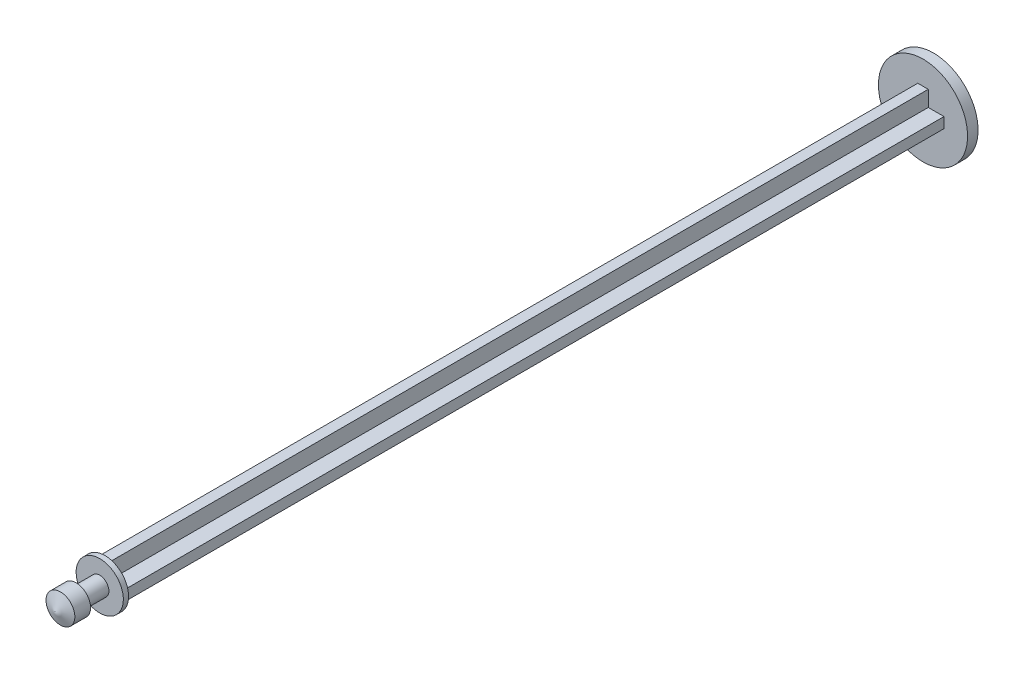
ISO-10303-21;
HEADER;
FILE_DESCRIPTION(('STEP AP214'),'2;1');
FILE_NAME('part.step','',(''),(''),'','','');
FILE_SCHEMA(('AUTOMOTIVE_DESIGN { 1 0 10303 214 1 1 1 1 }'));
ENDSEC;
DATA;
#1=APPLICATION_CONTEXT('core data for automotive mechanical design processes');
#2=APPLICATION_PROTOCOL_DEFINITION('international standard','automotive_design',2000,#1);
#3=PRODUCT_CONTEXT('',#1,'mechanical');
#4=PRODUCT('Part','Part','',(#3));
#5=PRODUCT_RELATED_PRODUCT_CATEGORY('part','',(#4));
#6=PRODUCT_DEFINITION_FORMATION('','',#4);
#7=PRODUCT_DEFINITION_CONTEXT('part definition',#1,'design');
#8=PRODUCT_DEFINITION('design','',#6,#7);
#9=PRODUCT_DEFINITION_SHAPE('','',#8);
#10=(LENGTH_UNIT() NAMED_UNIT(*) SI_UNIT(.MILLI.,.METRE.));
#11=(NAMED_UNIT(*) PLANE_ANGLE_UNIT() SI_UNIT($,.RADIAN.));
#12=(NAMED_UNIT(*) SI_UNIT($,.STERADIAN.) SOLID_ANGLE_UNIT());
#13=UNCERTAINTY_MEASURE_WITH_UNIT(LENGTH_MEASURE(1.E-05),#10,'distance_accuracy_value','');
#14=(GEOMETRIC_REPRESENTATION_CONTEXT(3) GLOBAL_UNCERTAINTY_ASSIGNED_CONTEXT((#13)) GLOBAL_UNIT_ASSIGNED_CONTEXT((#10,
#11,#12)) REPRESENTATION_CONTEXT('',''));
#15=CARTESIAN_POINT('',(0.,0.,0.));
#16=DIRECTION('',(0.,0.,1.));
#17=DIRECTION('',(1.,0.,0.));
#18=AXIS2_PLACEMENT_3D('',#15,#16,#17);
#19=CARTESIAN_POINT('',(2.,-0.5,78.));
#20=DIRECTION('',(-1.,0.,0.));
#21=DIRECTION('',(0.,0.,1.));
#22=AXIS2_PLACEMENT_3D('',#19,#20,#21);
#23=PLANE('',#22);
#24=DIRECTION('',(0.,1.,0.));
#25=VECTOR('',#24,1.);
#26=CARTESIAN_POINT('',(2.,-0.5,0.));
#27=LINE('',#26,#25);
#28=CARTESIAN_POINT('',(2.,-0.5,0.));
#29=VERTEX_POINT('',#28);
#30=CARTESIAN_POINT('',(2.,0.5,0.));
#31=VERTEX_POINT('',#30);
#32=EDGE_CURVE('E86',#29,#31,#27,.T.);
#33=ORIENTED_EDGE('',*,*,#32,.T.);
#34=DIRECTION('',(0.,0.,-1.));
#35=VECTOR('',#34,1.);
#36=CARTESIAN_POINT('',(2.,0.5,78.));
#37=LINE('',#36,#35);
#38=CARTESIAN_POINT('',(2.,0.5,78.));
#39=VERTEX_POINT('',#38);
#40=EDGE_CURVE('E51',#39,#31,#37,.T.);
#41=ORIENTED_EDGE('',*,*,#40,.F.);
#42=DIRECTION('',(0.,1.,0.));
#43=VECTOR('',#42,1.);
#44=CARTESIAN_POINT('',(2.,-0.5,78.));
#45=LINE('',#44,#43);
#46=CARTESIAN_POINT('',(2.,-0.5,78.));
#47=VERTEX_POINT('',#46);
#48=EDGE_CURVE('E195',#47,#39,#45,.T.);
#49=ORIENTED_EDGE('',*,*,#48,.F.);
#50=DIRECTION('',(0.,0.,-1.));
#51=VECTOR('',#50,1.);
#52=CARTESIAN_POINT('',(2.,-0.5,78.));
#53=LINE('',#52,#51);
#54=EDGE_CURVE('E155',#47,#29,#53,.T.);
#55=ORIENTED_EDGE('',*,*,#54,.T.);
#56=EDGE_LOOP('',(#33,#41,#49,#55));
#57=FACE_BOUND('',#56,.T.);
#58=ADVANCED_FACE('F41',(#57),#23,.F.);
#59=CARTESIAN_POINT('',(0.5,0.5,78.));
#60=DIRECTION('',(0.,-1.,0.));
#61=DIRECTION('',(0.,0.,-1.));
#62=AXIS2_PLACEMENT_3D('',#59,#60,#61);
#63=PLANE('',#62);
#64=DIRECTION('',(-1.,0.,0.));
#65=VECTOR('',#64,1.);
#66=CARTESIAN_POINT('',(0.5,0.5,0.));
#67=LINE('',#66,#65);
#68=CARTESIAN_POINT('',(0.5,0.5,0.));
#69=VERTEX_POINT('',#68);
#70=EDGE_CURVE('E158',#31,#69,#67,.T.);
#71=ORIENTED_EDGE('',*,*,#70,.T.);
#72=DIRECTION('',(0.,0.,-1.));
#73=VECTOR('',#72,1.);
#74=CARTESIAN_POINT('',(0.5,0.5,78.));
#75=LINE('',#74,#73);
#76=CARTESIAN_POINT('',(0.5,0.5,78.));
#77=VERTEX_POINT('',#76);
#78=EDGE_CURVE('E225',#77,#69,#75,.T.);
#79=ORIENTED_EDGE('',*,*,#78,.F.);
#80=DIRECTION('',(-1.,0.,0.));
#81=VECTOR('',#80,1.);
#82=CARTESIAN_POINT('',(0.5,0.5,78.));
#83=LINE('',#82,#81);
#84=EDGE_CURVE('E235',#39,#77,#83,.T.);
#85=ORIENTED_EDGE('',*,*,#84,.F.);
#86=ORIENTED_EDGE('',*,*,#40,.T.);
#87=EDGE_LOOP('',(#71,#79,#85,#86));
#88=FACE_BOUND('',#87,.T.);
#89=ADVANCED_FACE('F233',(#88),#63,.F.);
#90=CARTESIAN_POINT('',(0.5,0.5,78.));
#91=DIRECTION('',(-1.,0.,0.));
#92=DIRECTION('',(0.,-1.,0.));
#93=AXIS2_PLACEMENT_3D('',#90,#91,#92);
#94=PLANE('',#93);
#95=DIRECTION('',(0.,1.,0.));
#96=VECTOR('',#95,1.);
#97=CARTESIAN_POINT('',(0.5,0.5,0.));
#98=LINE('',#97,#96);
#99=CARTESIAN_POINT('',(0.5,2.,0.));
#100=VERTEX_POINT('',#99);
#101=EDGE_CURVE('E76',#69,#100,#98,.T.);
#102=ORIENTED_EDGE('',*,*,#101,.T.);
#103=DIRECTION('',(0.,0.,-1.));
#104=VECTOR('',#103,1.);
#105=CARTESIAN_POINT('',(0.5,2.,78.));
#106=LINE('',#105,#104);
#107=CARTESIAN_POINT('',(0.5,2.,78.));
#108=VERTEX_POINT('',#107);
#109=EDGE_CURVE('E221',#108,#100,#106,.T.);
#110=ORIENTED_EDGE('',*,*,#109,.F.);
#111=DIRECTION('',(0.,1.,0.));
#112=VECTOR('',#111,1.);
#113=CARTESIAN_POINT('',(0.5,0.5,78.));
#114=LINE('',#113,#112);
#115=EDGE_CURVE('E286',#77,#108,#114,.T.);
#116=ORIENTED_EDGE('',*,*,#115,.F.);
#117=ORIENTED_EDGE('',*,*,#78,.T.);
#118=EDGE_LOOP('',(#102,#110,#116,#117));
#119=FACE_BOUND('',#118,.T.);
#120=ADVANCED_FACE('F276',(#119),#94,.F.);
#121=CARTESIAN_POINT('',(-0.5,2.,78.));
#122=DIRECTION('',(0.,-1.,0.));
#123=DIRECTION('',(0.,0.,-1.));
#124=AXIS2_PLACEMENT_3D('',#121,#122,#123);
#125=PLANE('',#124);
#126=DIRECTION('',(-1.,0.,0.));
#127=VECTOR('',#126,1.);
#128=CARTESIAN_POINT('',(-0.5,2.,0.));
#129=LINE('',#128,#127);
#130=CARTESIAN_POINT('',(-0.5,2.,0.));
#131=VERTEX_POINT('',#130);
#132=EDGE_CURVE('E164',#100,#131,#129,.T.);
#133=ORIENTED_EDGE('',*,*,#132,.T.);
#134=DIRECTION('',(0.,0.,-1.));
#135=VECTOR('',#134,1.);
#136=CARTESIAN_POINT('',(-0.5,2.,78.));
#137=LINE('',#136,#135);
#138=CARTESIAN_POINT('',(-0.5,2.,78.));
#139=VERTEX_POINT('',#138);
#140=EDGE_CURVE('E217',#139,#131,#137,.T.);
#141=ORIENTED_EDGE('',*,*,#140,.F.);
#142=DIRECTION('',(-1.,0.,0.));
#143=VECTOR('',#142,1.);
#144=CARTESIAN_POINT('',(-0.5,2.,78.));
#145=LINE('',#144,#143);
#146=EDGE_CURVE('E281',#108,#139,#145,.T.);
#147=ORIENTED_EDGE('',*,*,#146,.F.);
#148=ORIENTED_EDGE('',*,*,#109,.T.);
#149=EDGE_LOOP('',(#133,#141,#147,#148));
#150=FACE_BOUND('',#149,.T.);
#151=ADVANCED_FACE('F279',(#150),#125,.F.);
#152=CARTESIAN_POINT('',(-0.5,0.5,78.));
#153=DIRECTION('',(1.,0.,0.));
#154=DIRECTION('',(0.,0.,-1.));
#155=AXIS2_PLACEMENT_3D('',#152,#153,#154);
#156=PLANE('',#155);
#157=DIRECTION('',(0.,-1.,0.));
#158=VECTOR('',#157,1.);
#159=CARTESIAN_POINT('',(-0.5,0.5,0.));
#160=LINE('',#159,#158);
#161=CARTESIAN_POINT('',(-0.5,0.5,0.));
#162=VERTEX_POINT('',#161);
#163=EDGE_CURVE('E168',#131,#162,#160,.T.);
#164=ORIENTED_EDGE('',*,*,#163,.T.);
#165=DIRECTION('',(0.,0.,-1.));
#166=VECTOR('',#165,1.);
#167=CARTESIAN_POINT('',(-0.5,0.5,78.));
#168=LINE('',#167,#166);
#169=CARTESIAN_POINT('',(-0.5,0.5,78.));
#170=VERTEX_POINT('',#169);
#171=EDGE_CURVE('E213',#170,#162,#168,.T.);
#172=ORIENTED_EDGE('',*,*,#171,.F.);
#173=DIRECTION('',(0.,-1.,0.));
#174=VECTOR('',#173,1.);
#175=CARTESIAN_POINT('',(-0.5,0.5,78.));
#176=LINE('',#175,#174);
#177=EDGE_CURVE('E285',#139,#170,#176,.T.);
#178=ORIENTED_EDGE('',*,*,#177,.F.);
#179=ORIENTED_EDGE('',*,*,#140,.T.);
#180=EDGE_LOOP('',(#164,#172,#178,#179));
#181=FACE_BOUND('',#180,.T.);
#182=ADVANCED_FACE('F304',(#181),#156,.F.);
#183=CARTESIAN_POINT('',(-2.,0.5,78.));
#184=DIRECTION('',(0.,-1.,0.));
#185=DIRECTION('',(0.,0.,-1.));
#186=AXIS2_PLACEMENT_3D('',#183,#184,#185);
#187=PLANE('',#186);
#188=DIRECTION('',(-1.,0.,0.));
#189=VECTOR('',#188,1.);
#190=CARTESIAN_POINT('',(-2.,0.5,0.));
#191=LINE('',#190,#189);
#192=CARTESIAN_POINT('',(-2.,0.5,0.));
#193=VERTEX_POINT('',#192);
#194=EDGE_CURVE('E172',#162,#193,#191,.T.);
#195=ORIENTED_EDGE('',*,*,#194,.T.);
#196=DIRECTION('',(0.,0.,-1.));
#197=VECTOR('',#196,1.);
#198=CARTESIAN_POINT('',(-2.,0.5,78.));
#199=LINE('',#198,#197);
#200=CARTESIAN_POINT('',(-2.,0.5,78.));
#201=VERTEX_POINT('',#200);
#202=EDGE_CURVE('E209',#201,#193,#199,.T.);
#203=ORIENTED_EDGE('',*,*,#202,.F.);
#204=DIRECTION('',(-1.,0.,0.));
#205=VECTOR('',#204,1.);
#206=CARTESIAN_POINT('',(-2.,0.5,78.));
#207=LINE('',#206,#205);
#208=EDGE_CURVE('E293',#170,#201,#207,.T.);
#209=ORIENTED_EDGE('',*,*,#208,.F.);
#210=ORIENTED_EDGE('',*,*,#171,.T.);
#211=EDGE_LOOP('',(#195,#203,#209,#210));
#212=FACE_BOUND('',#211,.T.);
#213=ADVANCED_FACE('F302',(#212),#187,.F.);
#214=CARTESIAN_POINT('',(-2.,-0.5,78.));
#215=DIRECTION('',(1.,0.,0.));
#216=DIRECTION('',(0.,1.,0.));
#217=AXIS2_PLACEMENT_3D('',#214,#215,#216);
#218=PLANE('',#217);
#219=DIRECTION('',(0.,-1.,0.));
#220=VECTOR('',#219,1.);
#221=CARTESIAN_POINT('',(-2.,-0.5,0.));
#222=LINE('',#221,#220);
#223=CARTESIAN_POINT('',(-2.,-0.5,0.));
#224=VERTEX_POINT('',#223);
#225=EDGE_CURVE('E176',#193,#224,#222,.T.);
#226=ORIENTED_EDGE('',*,*,#225,.T.);
#227=DIRECTION('',(0.,0.,-1.));
#228=VECTOR('',#227,1.);
#229=CARTESIAN_POINT('',(-2.,-0.5,78.));
#230=LINE('',#229,#228);
#231=CARTESIAN_POINT('',(-2.,-0.5,78.));
#232=VERTEX_POINT('',#231);
#233=EDGE_CURVE('E205',#232,#224,#230,.T.);
#234=ORIENTED_EDGE('',*,*,#233,.F.);
#235=DIRECTION('',(0.,-1.,0.));
#236=VECTOR('',#235,1.);
#237=CARTESIAN_POINT('',(-2.,-0.5,78.));
#238=LINE('',#237,#236);
#239=EDGE_CURVE('E148',#201,#232,#238,.T.);
#240=ORIENTED_EDGE('',*,*,#239,.F.);
#241=ORIENTED_EDGE('',*,*,#202,.T.);
#242=EDGE_LOOP('',(#226,#234,#240,#241));
#243=FACE_BOUND('',#242,.T.);
#244=ADVANCED_FACE('F298',(#243),#218,.F.);
#245=CARTESIAN_POINT('',(-2.,-0.5,78.));
#246=DIRECTION('',(0.,1.,0.));
#247=DIRECTION('',(0.,0.,1.));
#248=AXIS2_PLACEMENT_3D('',#245,#246,#247);
#249=PLANE('',#248);
#250=DIRECTION('',(1.,0.,0.));
#251=VECTOR('',#250,1.);
#252=CARTESIAN_POINT('',(-2.,-0.5,0.));
#253=LINE('',#252,#251);
#254=CARTESIAN_POINT('',(-0.5,-0.5,0.));
#255=VERTEX_POINT('',#254);
#256=EDGE_CURVE('E180',#224,#255,#253,.T.);
#257=ORIENTED_EDGE('',*,*,#256,.T.);
#258=DIRECTION('',(0.,0.,-1.));
#259=VECTOR('',#258,1.);
#260=CARTESIAN_POINT('',(-0.5,-0.5,78.));
#261=LINE('',#260,#259);
#262=CARTESIAN_POINT('',(-0.5,-0.5,78.));
#263=VERTEX_POINT('',#262);
#264=EDGE_CURVE('E130',#263,#255,#261,.T.);
#265=ORIENTED_EDGE('',*,*,#264,.F.);
#266=DIRECTION('',(1.,0.,0.));
#267=VECTOR('',#266,1.);
#268=CARTESIAN_POINT('',(-2.,-0.5,78.));
#269=LINE('',#268,#267);
#270=EDGE_CURVE('E146',#232,#263,#269,.T.);
#271=ORIENTED_EDGE('',*,*,#270,.F.);
#272=ORIENTED_EDGE('',*,*,#233,.T.);
#273=EDGE_LOOP('',(#257,#265,#271,#272));
#274=FACE_BOUND('',#273,.T.);
#275=ADVANCED_FACE('F300',(#274),#249,.F.);
#276=CARTESIAN_POINT('',(-0.5,-2.,78.));
#277=DIRECTION('',(1.,0.,0.));
#278=DIRECTION('',(0.,1.,0.));
#279=AXIS2_PLACEMENT_3D('',#276,#277,#278);
#280=PLANE('',#279);
#281=DIRECTION('',(0.,-1.,0.));
#282=VECTOR('',#281,1.);
#283=CARTESIAN_POINT('',(-0.5,-2.,0.));
#284=LINE('',#283,#282);
#285=CARTESIAN_POINT('',(-0.5,-2.,0.));
#286=VERTEX_POINT('',#285);
#287=EDGE_CURVE('E126',#255,#286,#284,.T.);
#288=ORIENTED_EDGE('',*,*,#287,.T.);
#289=DIRECTION('',(0.,0.,-1.));
#290=VECTOR('',#289,1.);
#291=CARTESIAN_POINT('',(-0.5,-2.,78.));
#292=LINE('',#291,#290);
#293=CARTESIAN_POINT('',(-0.5,-2.,78.));
#294=VERTEX_POINT('',#293);
#295=EDGE_CURVE('E117',#294,#286,#292,.T.);
#296=ORIENTED_EDGE('',*,*,#295,.F.);
#297=DIRECTION('',(0.,-1.,0.));
#298=VECTOR('',#297,1.);
#299=CARTESIAN_POINT('',(-0.5,-2.,78.));
#300=LINE('',#299,#298);
#301=EDGE_CURVE('E122',#263,#294,#300,.T.);
#302=ORIENTED_EDGE('',*,*,#301,.F.);
#303=ORIENTED_EDGE('',*,*,#264,.T.);
#304=EDGE_LOOP('',(#288,#296,#302,#303));
#305=FACE_BOUND('',#304,.T.);
#306=ADVANCED_FACE('F119',(#305),#280,.F.);
#307=CARTESIAN_POINT('',(-0.5,-2.,78.));
#308=DIRECTION('',(0.,1.,0.));
#309=DIRECTION('',(0.,0.,1.));
#310=AXIS2_PLACEMENT_3D('',#307,#308,#309);
#311=PLANE('',#310);
#312=DIRECTION('',(1.,0.,0.));
#313=VECTOR('',#312,1.);
#314=CARTESIAN_POINT('',(-0.5,-2.,0.));
#315=LINE('',#314,#313);
#316=CARTESIAN_POINT('',(0.5,-2.,0.));
#317=VERTEX_POINT('',#316);
#318=EDGE_CURVE('E186',#286,#317,#315,.T.);
#319=ORIENTED_EDGE('',*,*,#318,.T.);
#320=DIRECTION('',(0.,0.,-1.));
#321=VECTOR('',#320,1.);
#322=CARTESIAN_POINT('',(0.5,-2.,78.));
#323=LINE('',#322,#321);
#324=CARTESIAN_POINT('',(0.5,-2.,78.));
#325=VERTEX_POINT('',#324);
#326=EDGE_CURVE('E131',#325,#317,#323,.T.);
#327=ORIENTED_EDGE('',*,*,#326,.F.);
#328=DIRECTION('',(1.,0.,0.));
#329=VECTOR('',#328,1.);
#330=CARTESIAN_POINT('',(-0.5,-2.,78.));
#331=LINE('',#330,#329);
#332=EDGE_CURVE('E134',#294,#325,#331,.T.);
#333=ORIENTED_EDGE('',*,*,#332,.F.);
#334=ORIENTED_EDGE('',*,*,#295,.T.);
#335=EDGE_LOOP('',(#319,#327,#333,#334));
#336=FACE_BOUND('',#335,.T.);
#337=ADVANCED_FACE('F135',(#336),#311,.F.);
#338=CARTESIAN_POINT('',(0.5,-2.,78.));
#339=DIRECTION('',(-1.,0.,0.));
#340=DIRECTION('',(0.,-1.,0.));
#341=AXIS2_PLACEMENT_3D('',#338,#339,#340);
#342=PLANE('',#341);
#343=DIRECTION('',(0.,1.,0.));
#344=VECTOR('',#343,1.);
#345=CARTESIAN_POINT('',(0.5,-2.,0.));
#346=LINE('',#345,#344);
#347=CARTESIAN_POINT('',(0.5,-0.5,0.));
#348=VERTEX_POINT('',#347);
#349=EDGE_CURVE('E189',#317,#348,#346,.T.);
#350=ORIENTED_EDGE('',*,*,#349,.T.);
#351=DIRECTION('',(0.,0.,-1.));
#352=VECTOR('',#351,1.);
#353=CARTESIAN_POINT('',(0.5,-0.5,78.));
#354=LINE('',#353,#352);
#355=CARTESIAN_POINT('',(0.5,-0.5,78.));
#356=VERTEX_POINT('',#355);
#357=EDGE_CURVE('E59',#356,#348,#354,.T.);
#358=ORIENTED_EDGE('',*,*,#357,.F.);
#359=DIRECTION('',(0.,1.,0.));
#360=VECTOR('',#359,1.);
#361=CARTESIAN_POINT('',(0.5,-2.,78.));
#362=LINE('',#361,#360);
#363=EDGE_CURVE('E139',#325,#356,#362,.T.);
#364=ORIENTED_EDGE('',*,*,#363,.F.);
#365=ORIENTED_EDGE('',*,*,#326,.T.);
#366=EDGE_LOOP('',(#350,#358,#364,#365));
#367=FACE_BOUND('',#366,.T.);
#368=ADVANCED_FACE('F246',(#367),#342,.F.);
#369=CARTESIAN_POINT('',(0.5,-0.5,78.));
#370=DIRECTION('',(0.,1.,0.));
#371=DIRECTION('',(0.,0.,1.));
#372=AXIS2_PLACEMENT_3D('',#369,#370,#371);
#373=PLANE('',#372);
#374=DIRECTION('',(1.,0.,0.));
#375=VECTOR('',#374,1.);
#376=CARTESIAN_POINT('',(0.5,-0.5,0.));
#377=LINE('',#376,#375);
#378=EDGE_CURVE('E192',#348,#29,#377,.T.);
#379=ORIENTED_EDGE('',*,*,#378,.T.);
#380=ORIENTED_EDGE('',*,*,#54,.F.);
#381=DIRECTION('',(1.,0.,0.));
#382=VECTOR('',#381,1.);
#383=CARTESIAN_POINT('',(0.5,-0.5,78.));
#384=LINE('',#383,#382);
#385=EDGE_CURVE('E153',#356,#47,#384,.T.);
#386=ORIENTED_EDGE('',*,*,#385,.F.);
#387=ORIENTED_EDGE('',*,*,#357,.T.);
#388=EDGE_LOOP('',(#379,#380,#386,#387));
#389=FACE_BOUND('',#388,.T.);
#390=ADVANCED_FACE('F244',(#389),#373,.F.);
#391=CARTESIAN_POINT('',(0.,0.,-1.));
#392=DIRECTION('',(0.,0.,1.));
#393=DIRECTION('',(1.,0.,0.));
#394=AXIS2_PLACEMENT_3D('',#391,#392,#393);
#395=CYLINDRICAL_SURFACE('',#394,4.25);
#396=CARTESIAN_POINT('',(0.,0.,-1.));
#397=DIRECTION('',(0.,0.,-1.));
#398=DIRECTION('',(-1.,0.,0.));
#399=AXIS2_PLACEMENT_3D('',#396,#397,#398);
#400=CIRCLE('',#399,4.25);
#401=CARTESIAN_POINT('',(-4.25,0.,-1.));
#402=VERTEX_POINT('',#401);
#403=EDGE_CURVE('E159',#402,#402,#400,.T.);
#404=ORIENTED_EDGE('',*,*,#403,.F.);
#405=EDGE_LOOP('',(#404));
#406=FACE_BOUND('',#405,.T.);
#407=CARTESIAN_POINT('',(0.,0.,0.));
#408=DIRECTION('',(0.,0.,-1.));
#409=DIRECTION('',(-1.,0.,0.));
#410=AXIS2_PLACEMENT_3D('',#407,#408,#409);
#411=CIRCLE('',#410,4.25);
#412=CARTESIAN_POINT('',(-4.25,0.,0.));
#413=VERTEX_POINT('',#412);
#414=EDGE_CURVE('E482',#413,#413,#411,.T.);
#415=ORIENTED_EDGE('',*,*,#414,.T.);
#416=EDGE_LOOP('',(#415));
#417=FACE_BOUND('',#416,.T.);
#418=ADVANCED_FACE('F387',(#406,#417),#395,.T.);
#419=CARTESIAN_POINT('',(0.,0.,-1.));
#420=DIRECTION('',(0.,0.,-1.));
#421=DIRECTION('',(-1.,0.,0.));
#422=AXIS2_PLACEMENT_3D('',#419,#420,#421);
#423=PLANE('',#422);
#424=ORIENTED_EDGE('',*,*,#403,.T.);
#425=EDGE_LOOP('',(#424));
#426=FACE_BOUND('',#425,.T.);
#427=ADVANCED_FACE('F490',(#426),#423,.T.);
#428=CARTESIAN_POINT('',(0.,0.,0.));
#429=DIRECTION('',(0.,0.,-1.));
#430=DIRECTION('',(-1.,0.,0.));
#431=AXIS2_PLACEMENT_3D('',#428,#429,#430);
#432=PLANE('',#431);
#433=ORIENTED_EDGE('',*,*,#32,.F.);
#434=ORIENTED_EDGE('',*,*,#378,.F.);
#435=ORIENTED_EDGE('',*,*,#349,.F.);
#436=ORIENTED_EDGE('',*,*,#318,.F.);
#437=ORIENTED_EDGE('',*,*,#287,.F.);
#438=ORIENTED_EDGE('',*,*,#256,.F.);
#439=ORIENTED_EDGE('',*,*,#225,.F.);
#440=ORIENTED_EDGE('',*,*,#194,.F.);
#441=ORIENTED_EDGE('',*,*,#163,.F.);
#442=ORIENTED_EDGE('',*,*,#132,.F.);
#443=ORIENTED_EDGE('',*,*,#101,.F.);
#444=ORIENTED_EDGE('',*,*,#70,.F.);
#445=EDGE_LOOP('',(#433,#434,#435,#436,#437,#438,#439,#440,#441,#442,#443,#444));
#446=FACE_BOUND('',#445,.T.);
#447=ORIENTED_EDGE('',*,*,#414,.F.);
#448=EDGE_LOOP('',(#447));
#449=FACE_BOUND('',#448,.T.);
#450=ADVANCED_FACE('F272',(#446,#449),#432,.F.);
#451=CARTESIAN_POINT('',(0.,1.33594147302727,78.));
#452=DIRECTION('',(0.,0.,-1.));
#453=DIRECTION('',(0.,1.,0.));
#454=AXIS2_PLACEMENT_3D('',#451,#452,#453);
#455=PLANE('',#454);
#456=ORIENTED_EDGE('',*,*,#385,.T.);
#457=ORIENTED_EDGE('',*,*,#48,.T.);
#458=ORIENTED_EDGE('',*,*,#84,.T.);
#459=ORIENTED_EDGE('',*,*,#115,.T.);
#460=ORIENTED_EDGE('',*,*,#146,.T.);
#461=ORIENTED_EDGE('',*,*,#177,.T.);
#462=ORIENTED_EDGE('',*,*,#208,.T.);
#463=ORIENTED_EDGE('',*,*,#239,.T.);
#464=ORIENTED_EDGE('',*,*,#270,.T.);
#465=ORIENTED_EDGE('',*,*,#301,.T.);
#466=ORIENTED_EDGE('',*,*,#332,.T.);
#467=ORIENTED_EDGE('',*,*,#363,.T.);
#468=EDGE_LOOP('',(#456,#457,#458,#459,#460,#461,#462,#463,#464,#465,#466,#467));
#469=FACE_BOUND('',#468,.T.);
#470=CARTESIAN_POINT('',(0.,0.,78.));
#471=DIRECTION('',(0.,0.,-1.));
#472=DIRECTION('',(0.,1.,0.));
#473=AXIS2_PLACEMENT_3D('',#470,#471,#472);
#474=CIRCLE('',#473,2.25000000000001);
#475=CARTESIAN_POINT('',(0.,2.25,78.));
#476=VERTEX_POINT('',#475);
#477=EDGE_CURVE('E479',#476,#476,#474,.T.);
#478=ORIENTED_EDGE('',*,*,#477,.T.);
#479=EDGE_LOOP('',(#478));
#480=FACE_BOUND('',#479,.T.);
#481=ADVANCED_FACE('F142',(#469,#480),#455,.T.);
#482=CARTESIAN_POINT('',(0.,0.,-4.44195460498268E-12));
#483=DIRECTION('',(0.,0.,-1.));
#484=DIRECTION('',(0.,1.,0.));
#485=AXIS2_PLACEMENT_3D('',#482,#483,#484);
#486=CYLINDRICAL_SURFACE('',#485,2.25000000000001);
#487=CARTESIAN_POINT('',(0.,0.,78.5));
#488=DIRECTION('',(0.,0.,-1.));
#489=DIRECTION('',(0.,1.,0.));
#490=AXIS2_PLACEMENT_3D('',#487,#488,#489);
#491=CIRCLE('',#490,2.25000000000001);
#492=CARTESIAN_POINT('',(0.,2.25,78.5));
#493=VERTEX_POINT('',#492);
#494=EDGE_CURVE('E476',#493,#493,#491,.T.);
#495=ORIENTED_EDGE('',*,*,#494,.T.);
#496=EDGE_LOOP('',(#495));
#497=FACE_BOUND('',#496,.T.);
#498=ORIENTED_EDGE('',*,*,#477,.F.);
#499=EDGE_LOOP('',(#498));
#500=FACE_BOUND('',#499,.T.);
#501=ADVANCED_FACE('F398',(#497,#500),#486,.T.);
#502=CARTESIAN_POINT('',(0.,2.25,78.5));
#503=DIRECTION('',(0.,0.,1.));
#504=DIRECTION('',(0.,-1.,0.));
#505=AXIS2_PLACEMENT_3D('',#502,#503,#504);
#506=PLANE('',#505);
#507=CARTESIAN_POINT('',(0.,0.,78.5));
#508=DIRECTION('',(0.,0.,-1.));
#509=DIRECTION('',(0.,1.,0.));
#510=AXIS2_PLACEMENT_3D('',#507,#508,#509);
#511=CIRCLE('',#510,0.875);
#512=CARTESIAN_POINT('',(0.,0.87499999999999,78.5));
#513=VERTEX_POINT('',#512);
#514=EDGE_CURVE('E471',#513,#513,#511,.T.);
#515=ORIENTED_EDGE('',*,*,#514,.T.);
#516=EDGE_LOOP('',(#515));
#517=FACE_BOUND('',#516,.T.);
#518=ORIENTED_EDGE('',*,*,#494,.F.);
#519=EDGE_LOOP('',(#518));
#520=FACE_BOUND('',#519,.T.);
#521=ADVANCED_FACE('F409',(#517,#520),#506,.T.);
#522=CARTESIAN_POINT('',(0.,0.,-4.44195460498268E-12));
#523=DIRECTION('',(0.,0.,-1.));
#524=DIRECTION('',(0.,1.,0.));
#525=AXIS2_PLACEMENT_3D('',#522,#523,#524);
#526=CYLINDRICAL_SURFACE('',#525,0.875);
#527=CARTESIAN_POINT('',(0.,0.,80.75));
#528=DIRECTION('',(0.,0.,-1.));
#529=DIRECTION('',(0.,1.,0.));
#530=AXIS2_PLACEMENT_3D('',#527,#528,#529);
#531=CIRCLE('',#530,0.875);
#532=CARTESIAN_POINT('',(0.,0.87499999999999,80.75));
#533=VERTEX_POINT('',#532);
#534=EDGE_CURVE('E468',#533,#533,#531,.T.);
#535=ORIENTED_EDGE('',*,*,#534,.T.);
#536=EDGE_LOOP('',(#535));
#537=FACE_BOUND('',#536,.T.);
#538=ORIENTED_EDGE('',*,*,#514,.F.);
#539=EDGE_LOOP('',(#538));
#540=FACE_BOUND('',#539,.T.);
#541=ADVANCED_FACE('F419',(#537,#540),#526,.T.);
#542=CARTESIAN_POINT('',(0.,0.87499999999999,80.75));
#543=DIRECTION('',(0.,0.,-1.));
#544=DIRECTION('',(0.,1.,0.));
#545=AXIS2_PLACEMENT_3D('',#542,#543,#544);
#546=PLANE('',#545);
#547=CARTESIAN_POINT('',(0.,0.,80.75));
#548=DIRECTION('',(0.,0.,-1.));
#549=DIRECTION('',(0.,1.,0.));
#550=AXIS2_PLACEMENT_3D('',#547,#548,#549);
#551=CIRCLE('',#550,1.375);
#552=CARTESIAN_POINT('',(0.,1.37499999999999,80.75));
#553=VERTEX_POINT('',#552);
#554=EDGE_CURVE('E467',#553,#553,#551,.T.);
#555=ORIENTED_EDGE('',*,*,#554,.T.);
#556=EDGE_LOOP('',(#555));
#557=FACE_BOUND('',#556,.T.);
#558=ORIENTED_EDGE('',*,*,#534,.F.);
#559=EDGE_LOOP('',(#558));
#560=FACE_BOUND('',#559,.T.);
#561=ADVANCED_FACE('F429',(#557,#560),#546,.T.);
#562=CARTESIAN_POINT('',(0.,0.,-4.44195460498268E-12));
#563=DIRECTION('',(0.,0.,-1.));
#564=DIRECTION('',(0.,1.,0.));
#565=AXIS2_PLACEMENT_3D('',#562,#563,#564);
#566=CYLINDRICAL_SURFACE('',#565,1.375);
#567=CARTESIAN_POINT('',(0.,0.,82.249540927884));
#568=DIRECTION('',(0.,0.,1.));
#569=DIRECTION('',(0.,-1.,0.));
#570=AXIS2_PLACEMENT_3D('',#567,#568,#569);
#571=CIRCLE('',#570,1.375);
#572=CARTESIAN_POINT('',(0.,-1.37500000000001,82.249540927884));
#573=VERTEX_POINT('',#572);
#574=EDGE_CURVE('E11',#573,#573,#571,.F.);
#575=ORIENTED_EDGE('',*,*,#574,.T.);
#576=EDGE_LOOP('',(#575));
#577=FACE_BOUND('',#576,.T.);
#578=ORIENTED_EDGE('',*,*,#554,.F.);
#579=EDGE_LOOP('',(#578));
#580=FACE_BOUND('',#579,.T.);
#581=ADVANCED_FACE('F439',(#577,#580),#566,.T.);
#582=CARTESIAN_POINT('',(0.,0.,82.249540927884));
#583=DIRECTION('',(0.,0.,-1.));
#584=DIRECTION('',(0.,1.,0.));
#585=AXIS2_PLACEMENT_3D('',#582,#583,#584);
#586=CONICAL_SURFACE('',#585,1.37499999999996,1.22173047639603);
#587=CARTESIAN_POINT('',(0.,0.,82.75));
#588=VERTEX_POINT('',#587);
#589=VERTEX_LOOP('',#588);
#590=FACE_BOUND('',#589,.T.);
#591=ORIENTED_EDGE('',*,*,#574,.F.);
#592=EDGE_LOOP('',(#591));
#593=FACE_BOUND('',#592,.T.);
#594=ADVANCED_FACE('F44',(#590,#593),#586,.T.);
#595=CLOSED_SHELL('',(#58,#89,#120,#151,#182,#213,#244,#275,#306,#337,#368,#390,#418,#427,#450,
#481,#501,#521,#541,#561,#581,#594));
#596=MANIFOLD_SOLID_BREP('B2',#595);
#597=ADVANCED_BREP_SHAPE_REPRESENTATION('',(#18,#596),#14);
#598=SHAPE_DEFINITION_REPRESENTATION(#9,#597);
ENDSEC;
END-ISO-10303-21;
